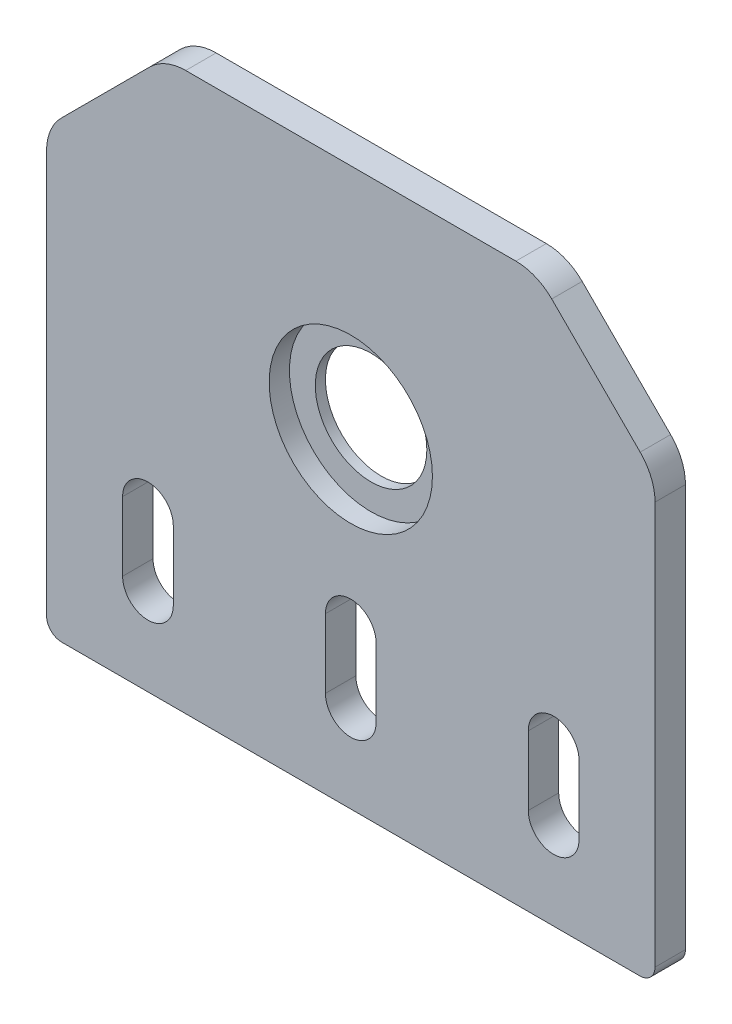
ISO-10303-21;
HEADER;
FILE_DESCRIPTION(('STEP AP214'),'2;1');
FILE_NAME('part.step','',(''),(''),'','','');
FILE_SCHEMA(('AUTOMOTIVE_DESIGN { 1 0 10303 214 1 1 1 1 }'));
ENDSEC;
DATA;
#1=APPLICATION_CONTEXT('core data for automotive mechanical design processes');
#2=APPLICATION_PROTOCOL_DEFINITION('international standard','automotive_design',2000,#1);
#3=PRODUCT_CONTEXT('',#1,'mechanical');
#4=PRODUCT('Part','Part','',(#3));
#5=PRODUCT_RELATED_PRODUCT_CATEGORY('part','',(#4));
#6=PRODUCT_DEFINITION_FORMATION('','',#4);
#7=PRODUCT_DEFINITION_CONTEXT('part definition',#1,'design');
#8=PRODUCT_DEFINITION('design','',#6,#7);
#9=PRODUCT_DEFINITION_SHAPE('','',#8);
#10=(LENGTH_UNIT() NAMED_UNIT(*) SI_UNIT(.MILLI.,.METRE.));
#11=(NAMED_UNIT(*) PLANE_ANGLE_UNIT() SI_UNIT($,.RADIAN.));
#12=(NAMED_UNIT(*) SI_UNIT($,.STERADIAN.) SOLID_ANGLE_UNIT());
#13=UNCERTAINTY_MEASURE_WITH_UNIT(LENGTH_MEASURE(1.E-05),#10,'distance_accuracy_value','');
#14=(GEOMETRIC_REPRESENTATION_CONTEXT(3) GLOBAL_UNCERTAINTY_ASSIGNED_CONTEXT((#13)) GLOBAL_UNIT_ASSIGNED_CONTEXT((#10,
#11,#12)) REPRESENTATION_CONTEXT('',''));
#15=CARTESIAN_POINT('',(0.,0.,0.));
#16=DIRECTION('',(0.,0.,1.));
#17=DIRECTION('',(1.,0.,0.));
#18=AXIS2_PLACEMENT_3D('',#15,#16,#17);
#19=CARTESIAN_POINT('',(0.,32.43,3.));
#20=DIRECTION('',(0.,0.,-1.));
#21=DIRECTION('',(-1.,0.,0.));
#22=AXIS2_PLACEMENT_3D('',#19,#20,#21);
#23=CYLINDRICAL_SURFACE('',#22,5.50000000000001);
#24=CARTESIAN_POINT('',(0.,32.43,0.));
#25=DIRECTION('',(0.,0.,1.));
#26=DIRECTION('',(1.,0.,0.));
#27=AXIS2_PLACEMENT_3D('',#24,#25,#26);
#28=CIRCLE('',#27,5.50000000000001);
#29=CARTESIAN_POINT('',(5.50000000000001,32.43,0.));
#30=VERTEX_POINT('',#29);
#31=EDGE_CURVE('E294',#30,#30,#28,.T.);
#32=ORIENTED_EDGE('',*,*,#31,.F.);
#33=EDGE_LOOP('',(#32));
#34=FACE_BOUND('',#33,.T.);
#35=CARTESIAN_POINT('',(0.,32.43,1.));
#36=DIRECTION('',(0.,0.,1.));
#37=DIRECTION('',(1.,0.,0.));
#38=AXIS2_PLACEMENT_3D('',#35,#36,#37);
#39=CIRCLE('',#38,5.50000000000001);
#40=CARTESIAN_POINT('',(5.50000000000001,32.43,1.));
#41=VERTEX_POINT('',#40);
#42=EDGE_CURVE('E37',#41,#41,#39,.T.);
#43=ORIENTED_EDGE('',*,*,#42,.T.);
#44=EDGE_LOOP('',(#43));
#45=FACE_BOUND('',#44,.T.);
#46=ADVANCED_FACE('F33',(#34,#45),#23,.F.);
#47=CARTESIAN_POINT('',(16.2789321880972,49.9300000000604,3.));
#48=DIRECTION('',(0.,0.,-1.));
#49=DIRECTION('',(-1.,0.,0.));
#50=AXIS2_PLACEMENT_3D('',#47,#48,#49);
#51=PLANE('',#50);
#52=CARTESIAN_POINT('',(0.,32.43,3.));
#53=DIRECTION('',(0.,0.,1.));
#54=DIRECTION('',(1.,0.,0.));
#55=AXIS2_PLACEMENT_3D('',#52,#53,#54);
#56=CIRCLE('',#55,8.05);
#57=CARTESIAN_POINT('',(8.05,32.43,3.));
#58=VERTEX_POINT('',#57);
#59=EDGE_CURVE('E703',#58,#58,#56,.T.);
#60=ORIENTED_EDGE('',*,*,#59,.F.);
#61=EDGE_LOOP('',(#60));
#62=FACE_BOUND('',#61,.T.);
#63=CARTESIAN_POINT('',(-20.,8.63,3.));
#64=DIRECTION('',(0.,0.,1.));
#65=DIRECTION('',(1.,0.,0.));
#66=AXIS2_PLACEMENT_3D('',#63,#64,#65);
#67=CIRCLE('',#66,2.5);
#68=CARTESIAN_POINT('',(-22.5,8.63,3.));
#69=VERTEX_POINT('',#68);
#70=CARTESIAN_POINT('',(-17.5,8.63,3.));
#71=VERTEX_POINT('',#70);
#72=EDGE_CURVE('E233',#69,#71,#67,.T.);
#73=ORIENTED_EDGE('',*,*,#72,.F.);
#74=DIRECTION('',(0.,-1.,0.));
#75=VECTOR('',#74,1.);
#76=CARTESIAN_POINT('',(-22.5,8.63,3.));
#77=LINE('',#76,#75);
#78=CARTESIAN_POINT('',(-22.5,15.43,3.));
#79=VERTEX_POINT('',#78);
#80=EDGE_CURVE('E241',#79,#69,#77,.T.);
#81=ORIENTED_EDGE('',*,*,#80,.F.);
#82=CARTESIAN_POINT('',(-20.,15.43,3.));
#83=DIRECTION('',(0.,0.,1.));
#84=DIRECTION('',(1.,0.,0.));
#85=AXIS2_PLACEMENT_3D('',#82,#83,#84);
#86=CIRCLE('',#85,2.5);
#87=CARTESIAN_POINT('',(-17.5,15.43,3.));
#88=VERTEX_POINT('',#87);
#89=EDGE_CURVE('E238',#88,#79,#86,.T.);
#90=ORIENTED_EDGE('',*,*,#89,.F.);
#91=DIRECTION('',(0.,1.,0.));
#92=VECTOR('',#91,1.);
#93=CARTESIAN_POINT('',(-17.5,8.63,3.));
#94=LINE('',#93,#92);
#95=EDGE_CURVE('E235',#71,#88,#94,.T.);
#96=ORIENTED_EDGE('',*,*,#95,.F.);
#97=EDGE_LOOP('',(#73,#81,#90,#96));
#98=FACE_BOUND('',#97,.T.);
#99=CARTESIAN_POINT('',(16.2789321880972,49.9300000000604,3.));
#100=DIRECTION('',(0.,0.,1.));
#101=DIRECTION('',(-1.,0.,0.));
#102=AXIS2_PLACEMENT_3D('',#99,#100,#101);
#103=CIRCLE('',#102,4.99999999996462);
#104=CARTESIAN_POINT('',(19.8144660940019,53.4655339059711,3.));
#105=VERTEX_POINT('',#104);
#106=CARTESIAN_POINT('',(16.2789321880972,54.930000000025,3.));
#107=VERTEX_POINT('',#106);
#108=EDGE_CURVE('E298',#105,#107,#103,.T.);
#109=ORIENTED_EDGE('',*,*,#108,.T.);
#110=DIRECTION('',(-1.,0.,0.));
#111=VECTOR('',#110,1.);
#112=CARTESIAN_POINT('',(16.2789321880972,54.930000000025,3.));
#113=LINE('',#112,#111);
#114=CARTESIAN_POINT('',(-16.2789321880972,54.930000000025,3.));
#115=VERTEX_POINT('',#114);
#116=EDGE_CURVE('E301',#107,#115,#113,.T.);
#117=ORIENTED_EDGE('',*,*,#116,.T.);
#118=CARTESIAN_POINT('',(-16.2789321880972,49.9300000000604,3.));
#119=DIRECTION('',(0.,0.,1.));
#120=DIRECTION('',(1.,0.,0.));
#121=AXIS2_PLACEMENT_3D('',#118,#119,#120);
#122=CIRCLE('',#121,4.99999999996461);
#123=CARTESIAN_POINT('',(-19.8144660940019,53.4655339059711,3.));
#124=VERTEX_POINT('',#123);
#125=EDGE_CURVE('E304',#115,#124,#122,.T.);
#126=ORIENTED_EDGE('',*,*,#125,.T.);
#127=DIRECTION('',(-0.70710678118714,-0.707106781185955,0.));
#128=VECTOR('',#127,1.);
#129=CARTESIAN_POINT('',(-19.8144660940019,53.4655339059711,3.));
#130=LINE('',#129,#128);
#131=CARTESIAN_POINT('',(-28.5355339059424,44.7444660940453,3.));
#132=VERTEX_POINT('',#131);
#133=EDGE_CURVE('E306',#124,#132,#130,.T.);
#134=ORIENTED_EDGE('',*,*,#133,.T.);
#135=CARTESIAN_POINT('',(-25.0000000000376,41.2089321881346,3.));
#136=DIRECTION('',(0.,0.,1.));
#137=DIRECTION('',(1.,0.,0.));
#138=AXIS2_PLACEMENT_3D('',#135,#136,#137);
#139=CIRCLE('',#138,4.99999999996461);
#140=CARTESIAN_POINT('',(-30.0000000000023,41.2089321881346,3.));
#141=VERTEX_POINT('',#140);
#142=EDGE_CURVE('E308',#132,#141,#139,.T.);
#143=ORIENTED_EDGE('',*,*,#142,.T.);
#144=DIRECTION('',(0.,-1.,0.));
#145=VECTOR('',#144,1.);
#146=CARTESIAN_POINT('',(-30.0000000000023,41.2089321881346,3.));
#147=LINE('',#146,#145);
#148=CARTESIAN_POINT('',(-30.0000000000023,1.5,3.));
#149=VERTEX_POINT('',#148);
#150=EDGE_CURVE('E310',#141,#149,#147,.T.);
#151=ORIENTED_EDGE('',*,*,#150,.T.);
#152=CARTESIAN_POINT('',(-28.5000000000023,1.5,3.));
#153=DIRECTION('',(0.,0.,1.));
#154=DIRECTION('',(1.,0.,0.));
#155=AXIS2_PLACEMENT_3D('',#152,#153,#154);
#156=CIRCLE('',#155,1.5);
#157=CARTESIAN_POINT('',(-28.5000000000023,0.,3.));
#158=VERTEX_POINT('',#157);
#159=EDGE_CURVE('E312',#149,#158,#156,.T.);
#160=ORIENTED_EDGE('',*,*,#159,.T.);
#161=DIRECTION('',(1.,0.,0.));
#162=VECTOR('',#161,1.);
#163=CARTESIAN_POINT('',(-28.5000000000023,0.,3.));
#164=LINE('',#163,#162);
#165=CARTESIAN_POINT('',(28.5000000000023,0.,3.));
#166=VERTEX_POINT('',#165);
#167=EDGE_CURVE('E314',#158,#166,#164,.T.);
#168=ORIENTED_EDGE('',*,*,#167,.T.);
#169=CARTESIAN_POINT('',(28.5000000000023,1.50000000000001,3.));
#170=DIRECTION('',(0.,0.,1.));
#171=DIRECTION('',(1.,0.,0.));
#172=AXIS2_PLACEMENT_3D('',#169,#170,#171);
#173=CIRCLE('',#172,1.5);
#174=CARTESIAN_POINT('',(30.0000000000023,1.50000000000001,3.));
#175=VERTEX_POINT('',#174);
#176=EDGE_CURVE('E316',#166,#175,#173,.T.);
#177=ORIENTED_EDGE('',*,*,#176,.T.);
#178=DIRECTION('',(0.,1.,0.));
#179=VECTOR('',#178,1.);
#180=CARTESIAN_POINT('',(30.0000000000023,41.2089321881345,3.));
#181=LINE('',#180,#179);
#182=CARTESIAN_POINT('',(30.0000000000023,41.2089321881345,3.));
#183=VERTEX_POINT('',#182);
#184=EDGE_CURVE('E318',#175,#183,#181,.T.);
#185=ORIENTED_EDGE('',*,*,#184,.T.);
#186=CARTESIAN_POINT('',(25.0000000000376,41.2089321881345,3.));
#187=DIRECTION('',(0.,0.,1.));
#188=DIRECTION('',(-1.,0.,0.));
#189=AXIS2_PLACEMENT_3D('',#186,#187,#188);
#190=CIRCLE('',#189,4.99999999996462);
#191=CARTESIAN_POINT('',(28.5355339059424,44.7444660940453,3.));
#192=VERTEX_POINT('',#191);
#193=EDGE_CURVE('E320',#183,#192,#190,.T.);
#194=ORIENTED_EDGE('',*,*,#193,.T.);
#195=DIRECTION('',(-0.70710678118714,0.707106781185955,0.));
#196=VECTOR('',#195,1.);
#197=CARTESIAN_POINT('',(19.8144660940019,53.4655339059711,3.));
#198=LINE('',#197,#196);
#199=EDGE_CURVE('E322',#192,#105,#198,.T.);
#200=ORIENTED_EDGE('',*,*,#199,.T.);
#201=EDGE_LOOP('',(#109,#117,#126,#134,#143,#151,#160,#168,#177,#185,#194,#200));
#202=FACE_BOUND('',#201,.T.);
#203=CARTESIAN_POINT('',(20.,8.62999999999999,3.));
#204=DIRECTION('',(0.,0.,1.));
#205=DIRECTION('',(-1.,0.,0.));
#206=AXIS2_PLACEMENT_3D('',#203,#204,#205);
#207=CIRCLE('',#206,2.5);
#208=CARTESIAN_POINT('',(17.5,8.62999999999999,3.));
#209=VERTEX_POINT('',#208);
#210=CARTESIAN_POINT('',(22.5,8.62999999999999,3.));
#211=VERTEX_POINT('',#210);
#212=EDGE_CURVE('E264',#209,#211,#207,.T.);
#213=ORIENTED_EDGE('',*,*,#212,.F.);
#214=DIRECTION('',(0.,-1.,0.));
#215=VECTOR('',#214,1.);
#216=CARTESIAN_POINT('',(17.5,8.62999999999999,3.));
#217=LINE('',#216,#215);
#218=CARTESIAN_POINT('',(17.5,15.43,3.));
#219=VERTEX_POINT('',#218);
#220=EDGE_CURVE('E272',#219,#209,#217,.T.);
#221=ORIENTED_EDGE('',*,*,#220,.F.);
#222=CARTESIAN_POINT('',(20.,15.43,3.));
#223=DIRECTION('',(0.,0.,1.));
#224=DIRECTION('',(-1.,0.,0.));
#225=AXIS2_PLACEMENT_3D('',#222,#223,#224);
#226=CIRCLE('',#225,2.5);
#227=CARTESIAN_POINT('',(22.5,15.43,3.));
#228=VERTEX_POINT('',#227);
#229=EDGE_CURVE('E269',#228,#219,#226,.T.);
#230=ORIENTED_EDGE('',*,*,#229,.F.);
#231=DIRECTION('',(0.,1.,0.));
#232=VECTOR('',#231,1.);
#233=CARTESIAN_POINT('',(22.5,8.62999999999999,3.));
#234=LINE('',#233,#232);
#235=EDGE_CURVE('E266',#211,#228,#234,.T.);
#236=ORIENTED_EDGE('',*,*,#235,.F.);
#237=EDGE_LOOP('',(#213,#221,#230,#236));
#238=FACE_BOUND('',#237,.T.);
#239=CARTESIAN_POINT('',(0.,8.63000000000001,3.));
#240=DIRECTION('',(0.,0.,1.));
#241=DIRECTION('',(1.,0.,0.));
#242=AXIS2_PLACEMENT_3D('',#239,#240,#241);
#243=CIRCLE('',#242,2.5);
#244=CARTESIAN_POINT('',(-2.5,8.63000000000001,3.));
#245=VERTEX_POINT('',#244);
#246=CARTESIAN_POINT('',(2.5,8.63000000000001,3.));
#247=VERTEX_POINT('',#246);
#248=EDGE_CURVE('E195',#245,#247,#243,.T.);
#249=ORIENTED_EDGE('',*,*,#248,.F.);
#250=DIRECTION('',(0.,-1.,0.));
#251=VECTOR('',#250,1.);
#252=CARTESIAN_POINT('',(-2.5,8.63000000000001,3.));
#253=LINE('',#252,#251);
#254=CARTESIAN_POINT('',(-2.5,15.43,3.));
#255=VERTEX_POINT('',#254);
#256=EDGE_CURVE('E218',#255,#245,#253,.T.);
#257=ORIENTED_EDGE('',*,*,#256,.F.);
#258=CARTESIAN_POINT('',(0.,15.43,3.));
#259=DIRECTION('',(0.,0.,1.));
#260=DIRECTION('',(1.,0.,0.));
#261=AXIS2_PLACEMENT_3D('',#258,#259,#260);
#262=CIRCLE('',#261,2.5);
#263=CARTESIAN_POINT('',(2.5,15.43,3.));
#264=VERTEX_POINT('',#263);
#265=EDGE_CURVE('E216',#264,#255,#262,.T.);
#266=ORIENTED_EDGE('',*,*,#265,.F.);
#267=DIRECTION('',(0.,1.,0.));
#268=VECTOR('',#267,1.);
#269=CARTESIAN_POINT('',(2.5,8.63000000000001,3.));
#270=LINE('',#269,#268);
#271=EDGE_CURVE('E203',#247,#264,#270,.T.);
#272=ORIENTED_EDGE('',*,*,#271,.F.);
#273=EDGE_LOOP('',(#249,#257,#266,#272));
#274=FACE_BOUND('',#273,.T.);
#275=ADVANCED_FACE('F215',(#62,#98,#202,#238,#274),#51,.F.);
#276=CARTESIAN_POINT('',(16.2789321880972,49.9300000000604,0.));
#277=DIRECTION('',(0.,0.,-1.));
#278=DIRECTION('',(-1.,0.,0.));
#279=AXIS2_PLACEMENT_3D('',#276,#277,#278);
#280=PLANE('',#279);
#281=CARTESIAN_POINT('',(16.2789321880972,49.9300000000604,0.));
#282=DIRECTION('',(0.,0.,1.));
#283=DIRECTION('',(-1.,0.,0.));
#284=AXIS2_PLACEMENT_3D('',#281,#282,#283);
#285=CIRCLE('',#284,4.99999999996462);
#286=CARTESIAN_POINT('',(19.8144660940019,53.4655339059711,0.));
#287=VERTEX_POINT('',#286);
#288=CARTESIAN_POINT('',(16.2789321880972,54.930000000025,0.));
#289=VERTEX_POINT('',#288);
#290=EDGE_CURVE('E297',#287,#289,#285,.T.);
#291=ORIENTED_EDGE('',*,*,#290,.F.);
#292=DIRECTION('',(-0.70710678118714,0.707106781185955,0.));
#293=VECTOR('',#292,1.);
#294=CARTESIAN_POINT('',(19.8144660940019,53.4655339059711,0.));
#295=LINE('',#294,#293);
#296=CARTESIAN_POINT('',(28.5355339059424,44.7444660940453,0.));
#297=VERTEX_POINT('',#296);
#298=EDGE_CURVE('E302',#297,#287,#295,.T.);
#299=ORIENTED_EDGE('',*,*,#298,.F.);
#300=CARTESIAN_POINT('',(25.0000000000376,41.2089321881345,0.));
#301=DIRECTION('',(0.,0.,1.));
#302=DIRECTION('',(-1.,0.,0.));
#303=AXIS2_PLACEMENT_3D('',#300,#301,#302);
#304=CIRCLE('',#303,4.99999999996462);
#305=CARTESIAN_POINT('',(30.0000000000023,41.2089321881345,0.));
#306=VERTEX_POINT('',#305);
#307=EDGE_CURVE('E345',#306,#297,#304,.T.);
#308=ORIENTED_EDGE('',*,*,#307,.F.);
#309=DIRECTION('',(0.,1.,0.));
#310=VECTOR('',#309,1.);
#311=CARTESIAN_POINT('',(30.0000000000023,41.2089321881345,0.));
#312=LINE('',#311,#310);
#313=CARTESIAN_POINT('',(30.0000000000023,1.50000000000001,0.));
#314=VERTEX_POINT('',#313);
#315=EDGE_CURVE('E343',#314,#306,#312,.T.);
#316=ORIENTED_EDGE('',*,*,#315,.F.);
#317=CARTESIAN_POINT('',(28.5000000000023,1.50000000000001,0.));
#318=DIRECTION('',(0.,0.,1.));
#319=DIRECTION('',(1.,0.,0.));
#320=AXIS2_PLACEMENT_3D('',#317,#318,#319);
#321=CIRCLE('',#320,1.5);
#322=CARTESIAN_POINT('',(28.5000000000023,0.,0.));
#323=VERTEX_POINT('',#322);
#324=EDGE_CURVE('E341',#323,#314,#321,.T.);
#325=ORIENTED_EDGE('',*,*,#324,.F.);
#326=DIRECTION('',(1.,0.,0.));
#327=VECTOR('',#326,1.);
#328=CARTESIAN_POINT('',(-28.5000000000023,0.,0.));
#329=LINE('',#328,#327);
#330=CARTESIAN_POINT('',(-28.5000000000023,0.,0.));
#331=VERTEX_POINT('',#330);
#332=EDGE_CURVE('E339',#331,#323,#329,.T.);
#333=ORIENTED_EDGE('',*,*,#332,.F.);
#334=CARTESIAN_POINT('',(-28.5000000000023,1.5,0.));
#335=DIRECTION('',(0.,0.,1.));
#336=DIRECTION('',(1.,0.,0.));
#337=AXIS2_PLACEMENT_3D('',#334,#335,#336);
#338=CIRCLE('',#337,1.5);
#339=CARTESIAN_POINT('',(-30.0000000000023,1.5,0.));
#340=VERTEX_POINT('',#339);
#341=EDGE_CURVE('E337',#340,#331,#338,.T.);
#342=ORIENTED_EDGE('',*,*,#341,.F.);
#343=DIRECTION('',(0.,-1.,0.));
#344=VECTOR('',#343,1.);
#345=CARTESIAN_POINT('',(-30.0000000000023,41.2089321881346,0.));
#346=LINE('',#345,#344);
#347=CARTESIAN_POINT('',(-30.0000000000023,41.2089321881346,0.));
#348=VERTEX_POINT('',#347);
#349=EDGE_CURVE('E335',#348,#340,#346,.T.);
#350=ORIENTED_EDGE('',*,*,#349,.F.);
#351=CARTESIAN_POINT('',(-25.0000000000376,41.2089321881346,0.));
#352=DIRECTION('',(0.,0.,1.));
#353=DIRECTION('',(1.,0.,0.));
#354=AXIS2_PLACEMENT_3D('',#351,#352,#353);
#355=CIRCLE('',#354,4.99999999996461);
#356=CARTESIAN_POINT('',(-28.5355339059424,44.7444660940453,0.));
#357=VERTEX_POINT('',#356);
#358=EDGE_CURVE('E333',#357,#348,#355,.T.);
#359=ORIENTED_EDGE('',*,*,#358,.F.);
#360=DIRECTION('',(-0.70710678118714,-0.707106781185955,0.));
#361=VECTOR('',#360,1.);
#362=CARTESIAN_POINT('',(-19.8144660940019,53.4655339059711,0.));
#363=LINE('',#362,#361);
#364=CARTESIAN_POINT('',(-19.8144660940019,53.4655339059711,0.));
#365=VERTEX_POINT('',#364);
#366=EDGE_CURVE('E331',#365,#357,#363,.T.);
#367=ORIENTED_EDGE('',*,*,#366,.F.);
#368=CARTESIAN_POINT('',(-16.2789321880972,49.9300000000604,0.));
#369=DIRECTION('',(0.,0.,1.));
#370=DIRECTION('',(1.,0.,0.));
#371=AXIS2_PLACEMENT_3D('',#368,#369,#370);
#372=CIRCLE('',#371,4.99999999996461);
#373=CARTESIAN_POINT('',(-16.2789321880972,54.930000000025,0.));
#374=VERTEX_POINT('',#373);
#375=EDGE_CURVE('E329',#374,#365,#372,.T.);
#376=ORIENTED_EDGE('',*,*,#375,.F.);
#377=DIRECTION('',(-1.,0.,0.));
#378=VECTOR('',#377,1.);
#379=CARTESIAN_POINT('',(16.2789321880972,54.930000000025,0.));
#380=LINE('',#379,#378);
#381=EDGE_CURVE('E327',#289,#374,#380,.T.);
#382=ORIENTED_EDGE('',*,*,#381,.F.);
#383=EDGE_LOOP('',(#291,#299,#308,#316,#325,#333,#342,#350,#359,#367,#376,#382));
#384=FACE_BOUND('',#383,.T.);
#385=ORIENTED_EDGE('',*,*,#31,.T.);
#386=EDGE_LOOP('',(#385));
#387=FACE_BOUND('',#386,.T.);
#388=DIRECTION('',(0.,-1.,0.));
#389=VECTOR('',#388,1.);
#390=CARTESIAN_POINT('',(17.5,8.62999999999999,0.));
#391=LINE('',#390,#389);
#392=CARTESIAN_POINT('',(17.5,15.43,0.));
#393=VERTEX_POINT('',#392);
#394=CARTESIAN_POINT('',(17.5,8.62999999999999,0.));
#395=VERTEX_POINT('',#394);
#396=EDGE_CURVE('E267',#393,#395,#391,.T.);
#397=ORIENTED_EDGE('',*,*,#396,.T.);
#398=CARTESIAN_POINT('',(20.,8.62999999999999,0.));
#399=DIRECTION('',(0.,0.,1.));
#400=DIRECTION('',(-1.,0.,0.));
#401=AXIS2_PLACEMENT_3D('',#398,#399,#400);
#402=CIRCLE('',#401,2.5);
#403=CARTESIAN_POINT('',(22.5,8.62999999999999,0.));
#404=VERTEX_POINT('',#403);
#405=EDGE_CURVE('E263',#395,#404,#402,.T.);
#406=ORIENTED_EDGE('',*,*,#405,.T.);
#407=DIRECTION('',(0.,1.,0.));
#408=VECTOR('',#407,1.);
#409=CARTESIAN_POINT('',(22.5,8.62999999999999,0.));
#410=LINE('',#409,#408);
#411=CARTESIAN_POINT('',(22.5,15.43,0.));
#412=VERTEX_POINT('',#411);
#413=EDGE_CURVE('E277',#404,#412,#410,.T.);
#414=ORIENTED_EDGE('',*,*,#413,.T.);
#415=CARTESIAN_POINT('',(20.,15.43,0.));
#416=DIRECTION('',(0.,0.,1.));
#417=DIRECTION('',(-1.,0.,0.));
#418=AXIS2_PLACEMENT_3D('',#415,#416,#417);
#419=CIRCLE('',#418,2.5);
#420=EDGE_CURVE('E280',#412,#393,#419,.T.);
#421=ORIENTED_EDGE('',*,*,#420,.T.);
#422=EDGE_LOOP('',(#397,#406,#414,#421));
#423=FACE_BOUND('',#422,.T.);
#424=DIRECTION('',(0.,-1.,0.));
#425=VECTOR('',#424,1.);
#426=CARTESIAN_POINT('',(-22.5,8.63,0.));
#427=LINE('',#426,#425);
#428=CARTESIAN_POINT('',(-22.5,15.43,0.));
#429=VERTEX_POINT('',#428);
#430=CARTESIAN_POINT('',(-22.5,8.63,0.));
#431=VERTEX_POINT('',#430);
#432=EDGE_CURVE('E236',#429,#431,#427,.T.);
#433=ORIENTED_EDGE('',*,*,#432,.T.);
#434=CARTESIAN_POINT('',(-20.,8.63,0.));
#435=DIRECTION('',(0.,0.,1.));
#436=DIRECTION('',(1.,0.,0.));
#437=AXIS2_PLACEMENT_3D('',#434,#435,#436);
#438=CIRCLE('',#437,2.5);
#439=CARTESIAN_POINT('',(-17.5,8.63,0.));
#440=VERTEX_POINT('',#439);
#441=EDGE_CURVE('E211',#431,#440,#438,.T.);
#442=ORIENTED_EDGE('',*,*,#441,.T.);
#443=DIRECTION('',(0.,1.,0.));
#444=VECTOR('',#443,1.);
#445=CARTESIAN_POINT('',(-17.5,8.63,0.));
#446=LINE('',#445,#444);
#447=CARTESIAN_POINT('',(-17.5,15.43,0.));
#448=VERTEX_POINT('',#447);
#449=EDGE_CURVE('E246',#440,#448,#446,.T.);
#450=ORIENTED_EDGE('',*,*,#449,.T.);
#451=CARTESIAN_POINT('',(-20.,15.43,0.));
#452=DIRECTION('',(0.,0.,1.));
#453=DIRECTION('',(1.,0.,0.));
#454=AXIS2_PLACEMENT_3D('',#451,#452,#453);
#455=CIRCLE('',#454,2.5);
#456=EDGE_CURVE('E249',#448,#429,#455,.T.);
#457=ORIENTED_EDGE('',*,*,#456,.T.);
#458=EDGE_LOOP('',(#433,#442,#450,#457));
#459=FACE_BOUND('',#458,.T.);
#460=DIRECTION('',(0.,-1.,0.));
#461=VECTOR('',#460,1.);
#462=CARTESIAN_POINT('',(-2.5,8.63000000000001,0.));
#463=LINE('',#462,#461);
#464=CARTESIAN_POINT('',(-2.5,15.43,0.));
#465=VERTEX_POINT('',#464);
#466=CARTESIAN_POINT('',(-2.5,8.63000000000001,0.));
#467=VERTEX_POINT('',#466);
#468=EDGE_CURVE('E204',#465,#467,#463,.T.);
#469=ORIENTED_EDGE('',*,*,#468,.T.);
#470=CARTESIAN_POINT('',(0.,8.63000000000001,0.));
#471=DIRECTION('',(0.,0.,1.));
#472=DIRECTION('',(1.,0.,0.));
#473=AXIS2_PLACEMENT_3D('',#470,#471,#472);
#474=CIRCLE('',#473,2.5);
#475=CARTESIAN_POINT('',(2.5,8.63000000000001,0.));
#476=VERTEX_POINT('',#475);
#477=EDGE_CURVE('E57',#467,#476,#474,.T.);
#478=ORIENTED_EDGE('',*,*,#477,.T.);
#479=DIRECTION('',(0.,1.,0.));
#480=VECTOR('',#479,1.);
#481=CARTESIAN_POINT('',(2.5,8.63000000000001,0.));
#482=LINE('',#481,#480);
#483=CARTESIAN_POINT('',(2.5,15.43,0.));
#484=VERTEX_POINT('',#483);
#485=EDGE_CURVE('E210',#476,#484,#482,.T.);
#486=ORIENTED_EDGE('',*,*,#485,.T.);
#487=CARTESIAN_POINT('',(0.,15.43,0.));
#488=DIRECTION('',(0.,0.,1.));
#489=DIRECTION('',(1.,0.,0.));
#490=AXIS2_PLACEMENT_3D('',#487,#488,#489);
#491=CIRCLE('',#490,2.5);
#492=EDGE_CURVE('E225',#484,#465,#491,.T.);
#493=ORIENTED_EDGE('',*,*,#492,.T.);
#494=EDGE_LOOP('',(#469,#478,#486,#493));
#495=FACE_BOUND('',#494,.T.);
#496=ADVANCED_FACE('F388',(#384,#387,#423,#459,#495),#280,.T.);
#497=CARTESIAN_POINT('',(16.2789321880972,49.9300000000604,3.));
#498=DIRECTION('',(0.,0.,-1.));
#499=DIRECTION('',(-1.,0.,0.));
#500=AXIS2_PLACEMENT_3D('',#497,#498,#499);
#501=CYLINDRICAL_SURFACE('',#500,4.99999999996462);
#502=ORIENTED_EDGE('',*,*,#290,.T.);
#503=DIRECTION('',(0.,0.,-1.));
#504=VECTOR('',#503,1.);
#505=CARTESIAN_POINT('',(16.2789321880972,54.930000000025,3.));
#506=LINE('',#505,#504);
#507=EDGE_CURVE('E11',#107,#289,#506,.T.);
#508=ORIENTED_EDGE('',*,*,#507,.F.);
#509=ORIENTED_EDGE('',*,*,#108,.F.);
#510=DIRECTION('',(0.,0.,-1.));
#511=VECTOR('',#510,1.);
#512=CARTESIAN_POINT('',(19.8144660940019,53.4655339059711,3.));
#513=LINE('',#512,#511);
#514=EDGE_CURVE('E324',#105,#287,#513,.T.);
#515=ORIENTED_EDGE('',*,*,#514,.T.);
#516=EDGE_LOOP('',(#502,#508,#509,#515));
#517=FACE_BOUND('',#516,.T.);
#518=ADVANCED_FACE('F35',(#517),#501,.T.);
#519=CARTESIAN_POINT('',(16.2789321880972,54.930000000025,3.));
#520=DIRECTION('',(0.,-1.,0.));
#521=DIRECTION('',(0.,0.,-1.));
#522=AXIS2_PLACEMENT_3D('',#519,#520,#521);
#523=PLANE('',#522);
#524=ORIENTED_EDGE('',*,*,#381,.T.);
#525=DIRECTION('',(0.,0.,-1.));
#526=VECTOR('',#525,1.);
#527=CARTESIAN_POINT('',(-16.2789321880972,54.930000000025,3.));
#528=LINE('',#527,#526);
#529=EDGE_CURVE('E42',#115,#374,#528,.T.);
#530=ORIENTED_EDGE('',*,*,#529,.F.);
#531=ORIENTED_EDGE('',*,*,#116,.F.);
#532=ORIENTED_EDGE('',*,*,#507,.T.);
#533=EDGE_LOOP('',(#524,#530,#531,#532));
#534=FACE_BOUND('',#533,.T.);
#535=ADVANCED_FACE('F406',(#534),#523,.F.);
#536=CARTESIAN_POINT('',(-16.2789321880972,49.9300000000604,3.));
#537=DIRECTION('',(0.,0.,-1.));
#538=DIRECTION('',(-1.,0.,0.));
#539=AXIS2_PLACEMENT_3D('',#536,#537,#538);
#540=CYLINDRICAL_SURFACE('',#539,4.99999999996461);
#541=ORIENTED_EDGE('',*,*,#375,.T.);
#542=DIRECTION('',(0.,0.,-1.));
#543=VECTOR('',#542,1.);
#544=CARTESIAN_POINT('',(-19.8144660940019,53.4655339059711,3.));
#545=LINE('',#544,#543);
#546=EDGE_CURVE('E374',#124,#365,#545,.T.);
#547=ORIENTED_EDGE('',*,*,#546,.F.);
#548=ORIENTED_EDGE('',*,*,#125,.F.);
#549=ORIENTED_EDGE('',*,*,#529,.T.);
#550=EDGE_LOOP('',(#541,#547,#548,#549));
#551=FACE_BOUND('',#550,.T.);
#552=ADVANCED_FACE('F382',(#551),#540,.T.);
#553=CARTESIAN_POINT('',(-19.8144660940019,53.4655339059711,3.));
#554=DIRECTION('',(0.707106781185955,-0.70710678118714,0.));
#555=DIRECTION('',(0.70710678118714,0.707106781185955,0.));
#556=AXIS2_PLACEMENT_3D('',#553,#554,#555);
#557=PLANE('',#556);
#558=ORIENTED_EDGE('',*,*,#366,.T.);
#559=DIRECTION('',(0.,0.,-1.));
#560=VECTOR('',#559,1.);
#561=CARTESIAN_POINT('',(-28.5355339059424,44.7444660940453,3.));
#562=LINE('',#561,#560);
#563=EDGE_CURVE('E371',#132,#357,#562,.T.);
#564=ORIENTED_EDGE('',*,*,#563,.F.);
#565=ORIENTED_EDGE('',*,*,#133,.F.);
#566=ORIENTED_EDGE('',*,*,#546,.T.);
#567=EDGE_LOOP('',(#558,#564,#565,#566));
#568=FACE_BOUND('',#567,.T.);
#569=ADVANCED_FACE('F394',(#568),#557,.F.);
#570=CARTESIAN_POINT('',(-25.0000000000376,41.2089321881346,3.));
#571=DIRECTION('',(0.,0.,-1.));
#572=DIRECTION('',(-1.,0.,0.));
#573=AXIS2_PLACEMENT_3D('',#570,#571,#572);
#574=CYLINDRICAL_SURFACE('',#573,4.99999999996461);
#575=ORIENTED_EDGE('',*,*,#358,.T.);
#576=DIRECTION('',(0.,0.,-1.));
#577=VECTOR('',#576,1.);
#578=CARTESIAN_POINT('',(-30.0000000000023,41.2089321881346,3.));
#579=LINE('',#578,#577);
#580=EDGE_CURVE('E368',#141,#348,#579,.T.);
#581=ORIENTED_EDGE('',*,*,#580,.F.);
#582=ORIENTED_EDGE('',*,*,#142,.F.);
#583=ORIENTED_EDGE('',*,*,#563,.T.);
#584=EDGE_LOOP('',(#575,#581,#582,#583));
#585=FACE_BOUND('',#584,.T.);
#586=ADVANCED_FACE('F398',(#585),#574,.T.);
#587=CARTESIAN_POINT('',(-30.0000000000023,41.2089321881346,3.));
#588=DIRECTION('',(1.,0.,0.));
#589=DIRECTION('',(0.,1.,0.));
#590=AXIS2_PLACEMENT_3D('',#587,#588,#589);
#591=PLANE('',#590);
#592=ORIENTED_EDGE('',*,*,#349,.T.);
#593=DIRECTION('',(0.,0.,-1.));
#594=VECTOR('',#593,1.);
#595=CARTESIAN_POINT('',(-30.0000000000023,1.5,3.));
#596=LINE('',#595,#594);
#597=EDGE_CURVE('E365',#149,#340,#596,.T.);
#598=ORIENTED_EDGE('',*,*,#597,.F.);
#599=ORIENTED_EDGE('',*,*,#150,.F.);
#600=ORIENTED_EDGE('',*,*,#580,.T.);
#601=EDGE_LOOP('',(#592,#598,#599,#600));
#602=FACE_BOUND('',#601,.T.);
#603=ADVANCED_FACE('F439',(#602),#591,.F.);
#604=CARTESIAN_POINT('',(-28.5000000000023,1.5,3.));
#605=DIRECTION('',(0.,0.,-1.));
#606=DIRECTION('',(-1.,0.,0.));
#607=AXIS2_PLACEMENT_3D('',#604,#605,#606);
#608=CYLINDRICAL_SURFACE('',#607,1.5);
#609=ORIENTED_EDGE('',*,*,#341,.T.);
#610=DIRECTION('',(0.,0.,-1.));
#611=VECTOR('',#610,1.);
#612=CARTESIAN_POINT('',(-28.5000000000023,0.,3.));
#613=LINE('',#612,#611);
#614=EDGE_CURVE('E362',#158,#331,#613,.T.);
#615=ORIENTED_EDGE('',*,*,#614,.F.);
#616=ORIENTED_EDGE('',*,*,#159,.F.);
#617=ORIENTED_EDGE('',*,*,#597,.T.);
#618=EDGE_LOOP('',(#609,#615,#616,#617));
#619=FACE_BOUND('',#618,.T.);
#620=ADVANCED_FACE('F437',(#619),#608,.T.);
#621=CARTESIAN_POINT('',(-28.5000000000023,0.,3.));
#622=DIRECTION('',(0.,1.,0.));
#623=DIRECTION('',(-1.,0.,0.));
#624=AXIS2_PLACEMENT_3D('',#621,#622,#623);
#625=PLANE('',#624);
#626=ORIENTED_EDGE('',*,*,#332,.T.);
#627=DIRECTION('',(0.,0.,-1.));
#628=VECTOR('',#627,1.);
#629=CARTESIAN_POINT('',(28.5000000000023,0.,3.));
#630=LINE('',#629,#628);
#631=EDGE_CURVE('E359',#166,#323,#630,.T.);
#632=ORIENTED_EDGE('',*,*,#631,.F.);
#633=ORIENTED_EDGE('',*,*,#167,.F.);
#634=ORIENTED_EDGE('',*,*,#614,.T.);
#635=EDGE_LOOP('',(#626,#632,#633,#634));
#636=FACE_BOUND('',#635,.T.);
#637=ADVANCED_FACE('F433',(#636),#625,.F.);
#638=CARTESIAN_POINT('',(28.5000000000023,1.50000000000001,3.));
#639=DIRECTION('',(0.,0.,-1.));
#640=DIRECTION('',(-1.,0.,0.));
#641=AXIS2_PLACEMENT_3D('',#638,#639,#640);
#642=CYLINDRICAL_SURFACE('',#641,1.5);
#643=ORIENTED_EDGE('',*,*,#324,.T.);
#644=DIRECTION('',(0.,0.,-1.));
#645=VECTOR('',#644,1.);
#646=CARTESIAN_POINT('',(30.0000000000023,1.50000000000001,3.));
#647=LINE('',#646,#645);
#648=EDGE_CURVE('E356',#175,#314,#647,.T.);
#649=ORIENTED_EDGE('',*,*,#648,.F.);
#650=ORIENTED_EDGE('',*,*,#176,.F.);
#651=ORIENTED_EDGE('',*,*,#631,.T.);
#652=EDGE_LOOP('',(#643,#649,#650,#651));
#653=FACE_BOUND('',#652,.T.);
#654=ADVANCED_FACE('F428',(#653),#642,.T.);
#655=CARTESIAN_POINT('',(30.0000000000023,41.2089321881345,3.));
#656=DIRECTION('',(-1.,0.,0.));
#657=DIRECTION('',(0.,0.,1.));
#658=AXIS2_PLACEMENT_3D('',#655,#656,#657);
#659=PLANE('',#658);
#660=ORIENTED_EDGE('',*,*,#315,.T.);
#661=DIRECTION('',(0.,0.,-1.));
#662=VECTOR('',#661,1.);
#663=CARTESIAN_POINT('',(30.0000000000023,41.2089321881345,3.));
#664=LINE('',#663,#662);
#665=EDGE_CURVE('E353',#183,#306,#664,.T.);
#666=ORIENTED_EDGE('',*,*,#665,.F.);
#667=ORIENTED_EDGE('',*,*,#184,.F.);
#668=ORIENTED_EDGE('',*,*,#648,.T.);
#669=EDGE_LOOP('',(#660,#666,#667,#668));
#670=FACE_BOUND('',#669,.T.);
#671=ADVANCED_FACE('F422',(#670),#659,.F.);
#672=CARTESIAN_POINT('',(25.0000000000376,41.2089321881345,3.));
#673=DIRECTION('',(0.,0.,-1.));
#674=DIRECTION('',(-1.,0.,0.));
#675=AXIS2_PLACEMENT_3D('',#672,#673,#674);
#676=CYLINDRICAL_SURFACE('',#675,4.99999999996462);
#677=ORIENTED_EDGE('',*,*,#307,.T.);
#678=DIRECTION('',(0.,0.,-1.));
#679=VECTOR('',#678,1.);
#680=CARTESIAN_POINT('',(28.5355339059424,44.7444660940453,3.));
#681=LINE('',#680,#679);
#682=EDGE_CURVE('E350',#192,#297,#681,.T.);
#683=ORIENTED_EDGE('',*,*,#682,.F.);
#684=ORIENTED_EDGE('',*,*,#193,.F.);
#685=ORIENTED_EDGE('',*,*,#665,.T.);
#686=EDGE_LOOP('',(#677,#683,#684,#685));
#687=FACE_BOUND('',#686,.T.);
#688=ADVANCED_FACE('F418',(#687),#676,.T.);
#689=CARTESIAN_POINT('',(19.8144660940019,53.4655339059711,3.));
#690=DIRECTION('',(-0.707106781185955,-0.70710678118714,0.));
#691=DIRECTION('',(0.70710678118714,-0.707106781185955,0.));
#692=AXIS2_PLACEMENT_3D('',#689,#690,#691);
#693=PLANE('',#692);
#694=ORIENTED_EDGE('',*,*,#298,.T.);
#695=ORIENTED_EDGE('',*,*,#514,.F.);
#696=ORIENTED_EDGE('',*,*,#199,.F.);
#697=ORIENTED_EDGE('',*,*,#682,.T.);
#698=EDGE_LOOP('',(#694,#695,#696,#697));
#699=FACE_BOUND('',#698,.T.);
#700=ADVANCED_FACE('F413',(#699),#693,.F.);
#701=CARTESIAN_POINT('',(20.,8.62999999999999,3.));
#702=DIRECTION('',(0.,0.,-1.));
#703=DIRECTION('',(-1.,0.,0.));
#704=AXIS2_PLACEMENT_3D('',#701,#702,#703);
#705=CYLINDRICAL_SURFACE('',#704,2.5);
#706=ORIENTED_EDGE('',*,*,#405,.F.);
#707=DIRECTION('',(0.,0.,-1.));
#708=VECTOR('',#707,1.);
#709=CARTESIAN_POINT('',(17.5,8.62999999999999,3.));
#710=LINE('',#709,#708);
#711=EDGE_CURVE('E274',#209,#395,#710,.T.);
#712=ORIENTED_EDGE('',*,*,#711,.F.);
#713=ORIENTED_EDGE('',*,*,#212,.T.);
#714=DIRECTION('',(0.,0.,-1.));
#715=VECTOR('',#714,1.);
#716=CARTESIAN_POINT('',(22.5,8.62999999999999,3.));
#717=LINE('',#716,#715);
#718=EDGE_CURVE('E291',#211,#404,#717,.T.);
#719=ORIENTED_EDGE('',*,*,#718,.T.);
#720=EDGE_LOOP('',(#706,#712,#713,#719));
#721=FACE_BOUND('',#720,.T.);
#722=ADVANCED_FACE('F459',(#721),#705,.F.);
#723=CARTESIAN_POINT('',(22.5,8.62999999999999,3.));
#724=DIRECTION('',(-1.,0.,0.));
#725=DIRECTION('',(0.,0.,1.));
#726=AXIS2_PLACEMENT_3D('',#723,#724,#725);
#727=PLANE('',#726);
#728=ORIENTED_EDGE('',*,*,#413,.F.);
#729=ORIENTED_EDGE('',*,*,#718,.F.);
#730=ORIENTED_EDGE('',*,*,#235,.T.);
#731=DIRECTION('',(0.,0.,-1.));
#732=VECTOR('',#731,1.);
#733=CARTESIAN_POINT('',(22.5,15.43,3.));
#734=LINE('',#733,#732);
#735=EDGE_CURVE('E289',#228,#412,#734,.T.);
#736=ORIENTED_EDGE('',*,*,#735,.T.);
#737=EDGE_LOOP('',(#728,#729,#730,#736));
#738=FACE_BOUND('',#737,.T.);
#739=ADVANCED_FACE('F499',(#738),#727,.T.);
#740=CARTESIAN_POINT('',(20.,15.43,3.));
#741=DIRECTION('',(0.,0.,-1.));
#742=DIRECTION('',(-1.,0.,0.));
#743=AXIS2_PLACEMENT_3D('',#740,#741,#742);
#744=CYLINDRICAL_SURFACE('',#743,2.5);
#745=ORIENTED_EDGE('',*,*,#420,.F.);
#746=ORIENTED_EDGE('',*,*,#735,.F.);
#747=ORIENTED_EDGE('',*,*,#229,.T.);
#748=DIRECTION('',(0.,0.,-1.));
#749=VECTOR('',#748,1.);
#750=CARTESIAN_POINT('',(17.5,15.43,3.));
#751=LINE('',#750,#749);
#752=EDGE_CURVE('E287',#219,#393,#751,.T.);
#753=ORIENTED_EDGE('',*,*,#752,.T.);
#754=EDGE_LOOP('',(#745,#746,#747,#753));
#755=FACE_BOUND('',#754,.T.);
#756=ADVANCED_FACE('F506',(#755),#744,.F.);
#757=CARTESIAN_POINT('',(17.5,8.62999999999999,3.));
#758=DIRECTION('',(1.,0.,0.));
#759=DIRECTION('',(0.,0.,-1.));
#760=AXIS2_PLACEMENT_3D('',#757,#758,#759);
#761=PLANE('',#760);
#762=ORIENTED_EDGE('',*,*,#396,.F.);
#763=ORIENTED_EDGE('',*,*,#752,.F.);
#764=ORIENTED_EDGE('',*,*,#220,.T.);
#765=ORIENTED_EDGE('',*,*,#711,.T.);
#766=EDGE_LOOP('',(#762,#763,#764,#765));
#767=FACE_BOUND('',#766,.T.);
#768=ADVANCED_FACE('F513',(#767),#761,.T.);
#769=CARTESIAN_POINT('',(-20.,8.63,3.));
#770=DIRECTION('',(0.,0.,-1.));
#771=DIRECTION('',(-1.,0.,0.));
#772=AXIS2_PLACEMENT_3D('',#769,#770,#771);
#773=CYLINDRICAL_SURFACE('',#772,2.5);
#774=ORIENTED_EDGE('',*,*,#441,.F.);
#775=DIRECTION('',(0.,0.,-1.));
#776=VECTOR('',#775,1.);
#777=CARTESIAN_POINT('',(-22.5,8.63,3.));
#778=LINE('',#777,#776);
#779=EDGE_CURVE('E243',#69,#431,#778,.T.);
#780=ORIENTED_EDGE('',*,*,#779,.F.);
#781=ORIENTED_EDGE('',*,*,#72,.T.);
#782=DIRECTION('',(0.,0.,-1.));
#783=VECTOR('',#782,1.);
#784=CARTESIAN_POINT('',(-17.5,8.63,3.));
#785=LINE('',#784,#783);
#786=EDGE_CURVE('E260',#71,#440,#785,.T.);
#787=ORIENTED_EDGE('',*,*,#786,.T.);
#788=EDGE_LOOP('',(#774,#780,#781,#787));
#789=FACE_BOUND('',#788,.T.);
#790=ADVANCED_FACE('F521',(#789),#773,.F.);
#791=CARTESIAN_POINT('',(-17.5,8.63,3.));
#792=DIRECTION('',(-1.,0.,0.));
#793=DIRECTION('',(0.,0.,1.));
#794=AXIS2_PLACEMENT_3D('',#791,#792,#793);
#795=PLANE('',#794);
#796=ORIENTED_EDGE('',*,*,#449,.F.);
#797=ORIENTED_EDGE('',*,*,#786,.F.);
#798=ORIENTED_EDGE('',*,*,#95,.T.);
#799=DIRECTION('',(0.,0.,-1.));
#800=VECTOR('',#799,1.);
#801=CARTESIAN_POINT('',(-17.5,15.43,3.));
#802=LINE('',#801,#800);
#803=EDGE_CURVE('E258',#88,#448,#802,.T.);
#804=ORIENTED_EDGE('',*,*,#803,.T.);
#805=EDGE_LOOP('',(#796,#797,#798,#804));
#806=FACE_BOUND('',#805,.T.);
#807=ADVANCED_FACE('F529',(#806),#795,.T.);
#808=CARTESIAN_POINT('',(-20.,15.43,3.));
#809=DIRECTION('',(0.,0.,-1.));
#810=DIRECTION('',(-1.,0.,0.));
#811=AXIS2_PLACEMENT_3D('',#808,#809,#810);
#812=CYLINDRICAL_SURFACE('',#811,2.5);
#813=ORIENTED_EDGE('',*,*,#456,.F.);
#814=ORIENTED_EDGE('',*,*,#803,.F.);
#815=ORIENTED_EDGE('',*,*,#89,.T.);
#816=DIRECTION('',(0.,0.,-1.));
#817=VECTOR('',#816,1.);
#818=CARTESIAN_POINT('',(-22.5,15.43,3.));
#819=LINE('',#818,#817);
#820=EDGE_CURVE('E256',#79,#429,#819,.T.);
#821=ORIENTED_EDGE('',*,*,#820,.T.);
#822=EDGE_LOOP('',(#813,#814,#815,#821));
#823=FACE_BOUND('',#822,.T.);
#824=ADVANCED_FACE('F537',(#823),#812,.F.);
#825=CARTESIAN_POINT('',(-22.5,8.63,3.));
#826=DIRECTION('',(1.,0.,0.));
#827=DIRECTION('',(0.,0.,-1.));
#828=AXIS2_PLACEMENT_3D('',#825,#826,#827);
#829=PLANE('',#828);
#830=ORIENTED_EDGE('',*,*,#432,.F.);
#831=ORIENTED_EDGE('',*,*,#820,.F.);
#832=ORIENTED_EDGE('',*,*,#80,.T.);
#833=ORIENTED_EDGE('',*,*,#779,.T.);
#834=EDGE_LOOP('',(#830,#831,#832,#833));
#835=FACE_BOUND('',#834,.T.);
#836=ADVANCED_FACE('F545',(#835),#829,.T.);
#837=CARTESIAN_POINT('',(0.,8.63000000000001,3.));
#838=DIRECTION('',(0.,0.,-1.));
#839=DIRECTION('',(-1.,0.,0.));
#840=AXIS2_PLACEMENT_3D('',#837,#838,#839);
#841=CYLINDRICAL_SURFACE('',#840,2.5);
#842=ORIENTED_EDGE('',*,*,#477,.F.);
#843=DIRECTION('',(0.,0.,-1.));
#844=VECTOR('',#843,1.);
#845=CARTESIAN_POINT('',(-2.5,8.63000000000001,3.));
#846=LINE('',#845,#844);
#847=EDGE_CURVE('E199',#245,#467,#846,.T.);
#848=ORIENTED_EDGE('',*,*,#847,.F.);
#849=ORIENTED_EDGE('',*,*,#248,.T.);
#850=DIRECTION('',(0.,0.,-1.));
#851=VECTOR('',#850,1.);
#852=CARTESIAN_POINT('',(2.5,8.63000000000001,3.));
#853=LINE('',#852,#851);
#854=EDGE_CURVE('E198',#247,#476,#853,.T.);
#855=ORIENTED_EDGE('',*,*,#854,.T.);
#856=EDGE_LOOP('',(#842,#848,#849,#855));
#857=FACE_BOUND('',#856,.T.);
#858=ADVANCED_FACE('F197',(#857),#841,.F.);
#859=CARTESIAN_POINT('',(2.5,8.63000000000001,3.));
#860=DIRECTION('',(-1.,0.,0.));
#861=DIRECTION('',(0.,0.,1.));
#862=AXIS2_PLACEMENT_3D('',#859,#860,#861);
#863=PLANE('',#862);
#864=ORIENTED_EDGE('',*,*,#485,.F.);
#865=ORIENTED_EDGE('',*,*,#854,.F.);
#866=ORIENTED_EDGE('',*,*,#271,.T.);
#867=DIRECTION('',(0.,0.,-1.));
#868=VECTOR('',#867,1.);
#869=CARTESIAN_POINT('',(2.5,15.43,3.));
#870=LINE('',#869,#868);
#871=EDGE_CURVE('E212',#264,#484,#870,.T.);
#872=ORIENTED_EDGE('',*,*,#871,.T.);
#873=EDGE_LOOP('',(#864,#865,#866,#872));
#874=FACE_BOUND('',#873,.T.);
#875=ADVANCED_FACE('F207',(#874),#863,.T.);
#876=CARTESIAN_POINT('',(0.,15.43,3.));
#877=DIRECTION('',(0.,0.,-1.));
#878=DIRECTION('',(-1.,0.,0.));
#879=AXIS2_PLACEMENT_3D('',#876,#877,#878);
#880=CYLINDRICAL_SURFACE('',#879,2.5);
#881=ORIENTED_EDGE('',*,*,#492,.F.);
#882=ORIENTED_EDGE('',*,*,#871,.F.);
#883=ORIENTED_EDGE('',*,*,#265,.T.);
#884=DIRECTION('',(0.,0.,-1.));
#885=VECTOR('',#884,1.);
#886=CARTESIAN_POINT('',(-2.5,15.43,3.));
#887=LINE('',#886,#885);
#888=EDGE_CURVE('E49',#255,#465,#887,.T.);
#889=ORIENTED_EDGE('',*,*,#888,.T.);
#890=EDGE_LOOP('',(#881,#882,#883,#889));
#891=FACE_BOUND('',#890,.T.);
#892=ADVANCED_FACE('F566',(#891),#880,.F.);
#893=CARTESIAN_POINT('',(-2.5,8.63000000000001,3.));
#894=DIRECTION('',(1.,0.,0.));
#895=DIRECTION('',(0.,0.,-1.));
#896=AXIS2_PLACEMENT_3D('',#893,#894,#895);
#897=PLANE('',#896);
#898=ORIENTED_EDGE('',*,*,#468,.F.);
#899=ORIENTED_EDGE('',*,*,#888,.F.);
#900=ORIENTED_EDGE('',*,*,#256,.T.);
#901=ORIENTED_EDGE('',*,*,#847,.T.);
#902=EDGE_LOOP('',(#898,#899,#900,#901));
#903=FACE_BOUND('',#902,.T.);
#904=ADVANCED_FACE('F573',(#903),#897,.T.);
#905=CARTESIAN_POINT('',(0.,32.43,1.));
#906=DIRECTION('',(0.,0.,1.));
#907=DIRECTION('',(1.,0.,0.));
#908=AXIS2_PLACEMENT_3D('',#905,#906,#907);
#909=CYLINDRICAL_SURFACE('',#908,8.05);
#910=CARTESIAN_POINT('',(0.,32.43,1.));
#911=DIRECTION('',(0.,0.,1.));
#912=DIRECTION('',(1.,0.,0.));
#913=AXIS2_PLACEMENT_3D('',#910,#911,#912);
#914=CIRCLE('',#913,8.05);
#915=CARTESIAN_POINT('',(8.05,32.43,1.));
#916=VERTEX_POINT('',#915);
#917=EDGE_CURVE('E702',#916,#916,#914,.T.);
#918=ORIENTED_EDGE('',*,*,#917,.F.);
#919=EDGE_LOOP('',(#918));
#920=FACE_BOUND('',#919,.T.);
#921=ORIENTED_EDGE('',*,*,#59,.T.);
#922=EDGE_LOOP('',(#921));
#923=FACE_BOUND('',#922,.T.);
#924=ADVANCED_FACE('F581',(#920,#923),#909,.F.);
#925=CARTESIAN_POINT('',(0.,32.43,1.));
#926=DIRECTION('',(0.,0.,1.));
#927=DIRECTION('',(1.,0.,0.));
#928=AXIS2_PLACEMENT_3D('',#925,#926,#927);
#929=PLANE('',#928);
#930=ORIENTED_EDGE('',*,*,#42,.F.);
#931=EDGE_LOOP('',(#930));
#932=FACE_BOUND('',#931,.T.);
#933=ORIENTED_EDGE('',*,*,#917,.T.);
#934=EDGE_LOOP('',(#933));
#935=FACE_BOUND('',#934,.T.);
#936=ADVANCED_FACE('F588',(#932,#935),#929,.T.);
#937=CLOSED_SHELL('',(#46,#275,#496,#518,#535,#552,#569,#586,#603,#620,#637,#654,#671,#688,#700,
#722,#739,#756,#768,#790,#807,#824,#836,#858,#875,#892,#904,#924,#936));
#938=MANIFOLD_SOLID_BREP('B2',#937);
#939=ADVANCED_BREP_SHAPE_REPRESENTATION('',(#18,#938),#14);
#940=SHAPE_DEFINITION_REPRESENTATION(#9,#939);
ENDSEC;
END-ISO-10303-21;
